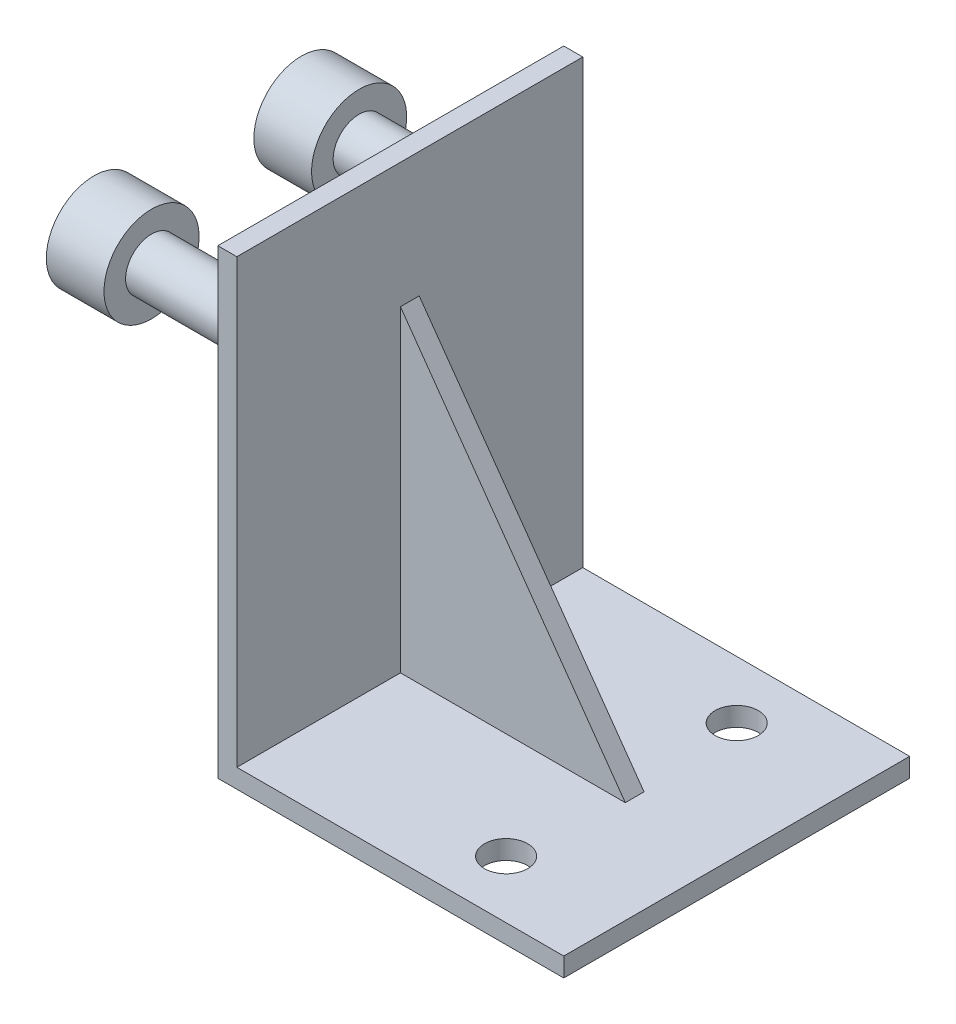
ISO-10303-21;
HEADER;
FILE_DESCRIPTION(('STEP AP214'),'2;1');
FILE_NAME('part.step','',(''),(''),'','','');
FILE_SCHEMA(('AUTOMOTIVE_DESIGN { 1 0 10303 214 1 1 1 1 }'));
ENDSEC;
DATA;
#1=APPLICATION_CONTEXT('core data for automotive mechanical design processes');
#2=APPLICATION_PROTOCOL_DEFINITION('international standard','automotive_design',2000,#1);
#3=PRODUCT_CONTEXT('',#1,'mechanical');
#4=PRODUCT('Part','Part','',(#3));
#5=PRODUCT_RELATED_PRODUCT_CATEGORY('part','',(#4));
#6=PRODUCT_DEFINITION_FORMATION('','',#4);
#7=PRODUCT_DEFINITION_CONTEXT('part definition',#1,'design');
#8=PRODUCT_DEFINITION('design','',#6,#7);
#9=PRODUCT_DEFINITION_SHAPE('','',#8);
#10=(LENGTH_UNIT() NAMED_UNIT(*) SI_UNIT(.MILLI.,.METRE.));
#11=(NAMED_UNIT(*) PLANE_ANGLE_UNIT() SI_UNIT($,.RADIAN.));
#12=(NAMED_UNIT(*) SI_UNIT($,.STERADIAN.) SOLID_ANGLE_UNIT());
#13=UNCERTAINTY_MEASURE_WITH_UNIT(LENGTH_MEASURE(1.E-05),#10,'distance_accuracy_value','');
#14=(GEOMETRIC_REPRESENTATION_CONTEXT(3) GLOBAL_UNCERTAINTY_ASSIGNED_CONTEXT((#13)) GLOBAL_UNIT_ASSIGNED_CONTEXT((#10,
#11,#12)) REPRESENTATION_CONTEXT('',''));
#15=CARTESIAN_POINT('',(0.,0.,0.));
#16=DIRECTION('',(0.,0.,1.));
#17=DIRECTION('',(1.,0.,0.));
#18=AXIS2_PLACEMENT_3D('',#15,#16,#17);
#19=CARTESIAN_POINT('',(0.,40.64,15.24));
#20=DIRECTION('',(0.,1.,0.));
#21=DIRECTION('',(0.,0.,1.));
#22=AXIS2_PLACEMENT_3D('',#19,#20,#21);
#23=PLANE('',#22);
#24=DIRECTION('',(1.,0.,0.));
#25=VECTOR('',#24,1.);
#26=CARTESIAN_POINT('',(0.,40.64,-15.24));
#27=LINE('',#26,#25);
#28=CARTESIAN_POINT('',(0.,40.64,-15.24));
#29=VERTEX_POINT('',#28);
#30=CARTESIAN_POINT('',(1.6764,40.64,-15.24));
#31=VERTEX_POINT('',#30);
#32=EDGE_CURVE('E161',#29,#31,#27,.T.);
#33=ORIENTED_EDGE('',*,*,#32,.F.);
#34=DIRECTION('',(0.,0.,-1.));
#35=VECTOR('',#34,1.);
#36=CARTESIAN_POINT('',(0.,40.64,15.24));
#37=LINE('',#36,#35);
#38=CARTESIAN_POINT('',(0.,40.64,15.24));
#39=VERTEX_POINT('',#38);
#40=EDGE_CURVE('E69',#39,#29,#37,.T.);
#41=ORIENTED_EDGE('',*,*,#40,.F.);
#42=DIRECTION('',(1.,0.,0.));
#43=VECTOR('',#42,1.);
#44=CARTESIAN_POINT('',(0.,40.64,15.24));
#45=LINE('',#44,#43);
#46=CARTESIAN_POINT('',(1.6764,40.64,15.24));
#47=VERTEX_POINT('',#46);
#48=EDGE_CURVE('E181',#39,#47,#45,.T.);
#49=ORIENTED_EDGE('',*,*,#48,.T.);
#50=DIRECTION('',(0.,0.,-1.));
#51=VECTOR('',#50,1.);
#52=CARTESIAN_POINT('',(1.6764,40.64,15.24));
#53=LINE('',#52,#51);
#54=EDGE_CURVE('E106',#47,#31,#53,.T.);
#55=ORIENTED_EDGE('',*,*,#54,.T.);
#56=EDGE_LOOP('',(#33,#41,#49,#55));
#57=FACE_BOUND('',#56,.T.);
#58=ADVANCED_FACE('F42',(#57),#23,.T.);
#59=CARTESIAN_POINT('',(0.,40.64,15.24));
#60=DIRECTION('',(1.,0.,0.));
#61=DIRECTION('',(0.,0.,-1.));
#62=AXIS2_PLACEMENT_3D('',#59,#60,#61);
#63=PLANE('',#62);
#64=CARTESIAN_POINT('',(0.,30.226,9.144));
#65=DIRECTION('',(1.,0.,0.));
#66=DIRECTION('',(0.,0.,-1.));
#67=AXIS2_PLACEMENT_3D('',#64,#65,#66);
#68=CIRCLE('',#67,2.286);
#69=CARTESIAN_POINT('',(0.,30.226,6.858));
#70=VERTEX_POINT('',#69);
#71=EDGE_CURVE('E11',#70,#70,#68,.F.);
#72=ORIENTED_EDGE('',*,*,#71,.F.);
#73=EDGE_LOOP('',(#72));
#74=FACE_BOUND('',#73,.T.);
#75=CARTESIAN_POINT('',(0.,30.226,-9.144));
#76=DIRECTION('',(1.,0.,0.));
#77=DIRECTION('',(0.,0.,-1.));
#78=AXIS2_PLACEMENT_3D('',#75,#76,#77);
#79=CIRCLE('',#78,2.286);
#80=CARTESIAN_POINT('',(0.,30.226,-11.43));
#81=VERTEX_POINT('',#80);
#82=EDGE_CURVE('E50',#81,#81,#79,.F.);
#83=ORIENTED_EDGE('',*,*,#82,.F.);
#84=EDGE_LOOP('',(#83));
#85=FACE_BOUND('',#84,.T.);
#86=DIRECTION('',(0.,-1.,0.));
#87=VECTOR('',#86,1.);
#88=CARTESIAN_POINT('',(0.,40.64,-15.24));
#89=LINE('',#88,#87);
#90=CARTESIAN_POINT('',(0.,0.,-15.24));
#91=VERTEX_POINT('',#90);
#92=EDGE_CURVE('E178',#29,#91,#89,.T.);
#93=ORIENTED_EDGE('',*,*,#92,.T.);
#94=DIRECTION('',(0.,0.,-1.));
#95=VECTOR('',#94,1.);
#96=CARTESIAN_POINT('',(0.,0.,15.24));
#97=LINE('',#96,#95);
#98=CARTESIAN_POINT('',(0.,0.,15.24));
#99=VERTEX_POINT('',#98);
#100=EDGE_CURVE('E145',#99,#91,#97,.T.);
#101=ORIENTED_EDGE('',*,*,#100,.F.);
#102=DIRECTION('',(0.,-1.,0.));
#103=VECTOR('',#102,1.);
#104=CARTESIAN_POINT('',(0.,40.64,15.24));
#105=LINE('',#104,#103);
#106=EDGE_CURVE('E130',#39,#99,#105,.T.);
#107=ORIENTED_EDGE('',*,*,#106,.F.);
#108=ORIENTED_EDGE('',*,*,#40,.T.);
#109=EDGE_LOOP('',(#93,#101,#107,#108));
#110=FACE_BOUND('',#109,.T.);
#111=ADVANCED_FACE('F198',(#74,#85,#110),#63,.F.);
#112=CARTESIAN_POINT('',(0.,0.,15.24));
#113=DIRECTION('',(0.,1.,0.));
#114=DIRECTION('',(0.,0.,1.));
#115=AXIS2_PLACEMENT_3D('',#112,#113,#114);
#116=PLANE('',#115);
#117=CARTESIAN_POINT('',(20.32,0.,-10.16));
#118=DIRECTION('',(0.,1.,0.));
#119=DIRECTION('',(0.,0.,1.));
#120=AXIS2_PLACEMENT_3D('',#117,#118,#119);
#121=CIRCLE('',#120,1.905);
#122=CARTESIAN_POINT('',(20.32,0.,-8.255));
#123=VERTEX_POINT('',#122);
#124=EDGE_CURVE('E233',#123,#123,#121,.T.);
#125=ORIENTED_EDGE('',*,*,#124,.T.);
#126=EDGE_LOOP('',(#125));
#127=FACE_BOUND('',#126,.T.);
#128=CARTESIAN_POINT('',(20.32,0.,10.16));
#129=DIRECTION('',(0.,1.,0.));
#130=DIRECTION('',(0.,0.,1.));
#131=AXIS2_PLACEMENT_3D('',#128,#129,#130);
#132=CIRCLE('',#131,1.905);
#133=CARTESIAN_POINT('',(20.32,0.,12.065));
#134=VERTEX_POINT('',#133);
#135=EDGE_CURVE('E248',#134,#134,#132,.T.);
#136=ORIENTED_EDGE('',*,*,#135,.T.);
#137=EDGE_LOOP('',(#136));
#138=FACE_BOUND('',#137,.T.);
#139=DIRECTION('',(1.,0.,0.));
#140=VECTOR('',#139,1.);
#141=CARTESIAN_POINT('',(0.,0.,-15.24));
#142=LINE('',#141,#140);
#143=CARTESIAN_POINT('',(30.48,0.,-15.24));
#144=VERTEX_POINT('',#143);
#145=EDGE_CURVE('E140',#91,#144,#142,.T.);
#146=ORIENTED_EDGE('',*,*,#145,.T.);
#147=DIRECTION('',(0.,0.,-1.));
#148=VECTOR('',#147,1.);
#149=CARTESIAN_POINT('',(30.48,0.,15.24));
#150=LINE('',#149,#148);
#151=CARTESIAN_POINT('',(30.48,0.,15.24));
#152=VERTEX_POINT('',#151);
#153=EDGE_CURVE('E137',#152,#144,#150,.T.);
#154=ORIENTED_EDGE('',*,*,#153,.F.);
#155=DIRECTION('',(1.,0.,0.));
#156=VECTOR('',#155,1.);
#157=CARTESIAN_POINT('',(0.,0.,15.24));
#158=LINE('',#157,#156);
#159=EDGE_CURVE('E122',#99,#152,#158,.T.);
#160=ORIENTED_EDGE('',*,*,#159,.F.);
#161=ORIENTED_EDGE('',*,*,#100,.T.);
#162=EDGE_LOOP('',(#146,#154,#160,#161));
#163=FACE_BOUND('',#162,.T.);
#164=ADVANCED_FACE('F138',(#127,#138,#163),#116,.F.);
#165=CARTESIAN_POINT('',(30.48,0.,15.24));
#166=DIRECTION('',(-1.,0.,0.));
#167=DIRECTION('',(0.,0.,1.));
#168=AXIS2_PLACEMENT_3D('',#165,#166,#167);
#169=PLANE('',#168);
#170=DIRECTION('',(0.,1.,0.));
#171=VECTOR('',#170,1.);
#172=CARTESIAN_POINT('',(30.48,0.,-15.24));
#173=LINE('',#172,#171);
#174=CARTESIAN_POINT('',(30.48,1.6764,-15.24));
#175=VERTEX_POINT('',#174);
#176=EDGE_CURVE('E173',#144,#175,#173,.T.);
#177=ORIENTED_EDGE('',*,*,#176,.T.);
#178=DIRECTION('',(0.,0.,-1.));
#179=VECTOR('',#178,1.);
#180=CARTESIAN_POINT('',(30.48,1.6764,15.24));
#181=LINE('',#180,#179);
#182=CARTESIAN_POINT('',(30.48,1.6764,15.24));
#183=VERTEX_POINT('',#182);
#184=EDGE_CURVE('E146',#183,#175,#181,.T.);
#185=ORIENTED_EDGE('',*,*,#184,.F.);
#186=DIRECTION('',(0.,1.,0.));
#187=VECTOR('',#186,1.);
#188=CARTESIAN_POINT('',(30.48,0.,15.24));
#189=LINE('',#188,#187);
#190=EDGE_CURVE('E128',#152,#183,#189,.T.);
#191=ORIENTED_EDGE('',*,*,#190,.F.);
#192=ORIENTED_EDGE('',*,*,#153,.T.);
#193=EDGE_LOOP('',(#177,#185,#191,#192));
#194=FACE_BOUND('',#193,.T.);
#195=ADVANCED_FACE('F148',(#194),#169,.F.);
#196=CARTESIAN_POINT('',(1.6764,1.6764,15.24));
#197=DIRECTION('',(0.,1.,0.));
#198=DIRECTION('',(0.,0.,1.));
#199=AXIS2_PLACEMENT_3D('',#196,#197,#198);
#200=PLANE('',#199);
#201=CARTESIAN_POINT('',(20.32,1.6764,-10.16));
#202=DIRECTION('',(0.,1.,0.));
#203=DIRECTION('',(0.,0.,1.));
#204=AXIS2_PLACEMENT_3D('',#201,#202,#203);
#205=CIRCLE('',#204,1.905);
#206=CARTESIAN_POINT('',(20.32,1.6764,-8.255));
#207=VERTEX_POINT('',#206);
#208=EDGE_CURVE('E253',#207,#207,#205,.T.);
#209=ORIENTED_EDGE('',*,*,#208,.F.);
#210=EDGE_LOOP('',(#209));
#211=FACE_BOUND('',#210,.T.);
#212=CARTESIAN_POINT('',(20.32,1.6764,10.16));
#213=DIRECTION('',(0.,1.,0.));
#214=DIRECTION('',(0.,0.,1.));
#215=AXIS2_PLACEMENT_3D('',#212,#213,#214);
#216=CIRCLE('',#215,1.905);
#217=CARTESIAN_POINT('',(20.32,1.6764,12.065));
#218=VERTEX_POINT('',#217);
#219=EDGE_CURVE('E244',#218,#218,#216,.T.);
#220=ORIENTED_EDGE('',*,*,#219,.F.);
#221=EDGE_LOOP('',(#220));
#222=FACE_BOUND('',#221,.T.);
#223=DIRECTION('',(1.,0.,0.));
#224=VECTOR('',#223,1.);
#225=CARTESIAN_POINT('',(21.4884,1.6764,0.8255));
#226=LINE('',#225,#224);
#227=CARTESIAN_POINT('',(1.6764,1.6764,0.8255));
#228=VERTEX_POINT('',#227);
#229=CARTESIAN_POINT('',(21.4884,1.6764,0.8255));
#230=VERTEX_POINT('',#229);
#231=EDGE_CURVE('E237',#228,#230,#226,.T.);
#232=ORIENTED_EDGE('',*,*,#231,.F.);
#233=DIRECTION('',(0.,0.,-1.));
#234=VECTOR('',#233,1.);
#235=CARTESIAN_POINT('',(1.6764,1.6764,15.24));
#236=LINE('',#235,#234);
#237=CARTESIAN_POINT('',(1.6764,1.6764,15.24));
#238=VERTEX_POINT('',#237);
#239=EDGE_CURVE('E187',#238,#228,#236,.T.);
#240=ORIENTED_EDGE('',*,*,#239,.F.);
#241=DIRECTION('',(1.,0.,0.));
#242=VECTOR('',#241,1.);
#243=CARTESIAN_POINT('',(1.6764,1.6764,15.24));
#244=LINE('',#243,#242);
#245=EDGE_CURVE('E151',#238,#183,#244,.T.);
#246=ORIENTED_EDGE('',*,*,#245,.T.);
#247=ORIENTED_EDGE('',*,*,#184,.T.);
#248=DIRECTION('',(1.,0.,0.));
#249=VECTOR('',#248,1.);
#250=CARTESIAN_POINT('',(1.6764,1.6764,-15.24));
#251=LINE('',#250,#249);
#252=CARTESIAN_POINT('',(1.6764,1.6764,-15.24));
#253=VERTEX_POINT('',#252);
#254=EDGE_CURVE('E169',#253,#175,#251,.T.);
#255=ORIENTED_EDGE('',*,*,#254,.F.);
#256=CARTESIAN_POINT('',(1.6764,1.6764,-0.825499999999995));
#257=VERTEX_POINT('',#256);
#258=EDGE_CURVE('E191',#257,#253,#236,.T.);
#259=ORIENTED_EDGE('',*,*,#258,.F.);
#260=DIRECTION('',(1.,0.,0.));
#261=VECTOR('',#260,1.);
#262=CARTESIAN_POINT('',(21.4884,1.6764,-0.8255));
#263=LINE('',#262,#261);
#264=CARTESIAN_POINT('',(21.4884,1.6764,-0.8255));
#265=VERTEX_POINT('',#264);
#266=EDGE_CURVE('E60',#257,#265,#263,.T.);
#267=ORIENTED_EDGE('',*,*,#266,.T.);
#268=DIRECTION('',(0.,0.,-1.));
#269=VECTOR('',#268,1.);
#270=CARTESIAN_POINT('',(21.4884,1.6764,0.8255));
#271=LINE('',#270,#269);
#272=EDGE_CURVE('E165',#230,#265,#271,.T.);
#273=ORIENTED_EDGE('',*,*,#272,.F.);
#274=EDGE_LOOP('',(#232,#240,#246,#247,#255,#259,#267,#273));
#275=FACE_BOUND('',#274,.T.);
#276=ADVANCED_FACE('F208',(#211,#222,#275),#200,.T.);
#277=CARTESIAN_POINT('',(1.6764,40.64,15.24));
#278=DIRECTION('',(1.,0.,0.));
#279=DIRECTION('',(0.,1.,0.));
#280=AXIS2_PLACEMENT_3D('',#277,#278,#279);
#281=PLANE('',#280);
#282=DIRECTION('',(0.,-1.,0.));
#283=VECTOR('',#282,1.);
#284=CARTESIAN_POINT('',(1.6764,1.6764,0.8255));
#285=LINE('',#284,#283);
#286=CARTESIAN_POINT('',(1.6764,29.6164,0.8255));
#287=VERTEX_POINT('',#286);
#288=EDGE_CURVE('E227',#287,#228,#285,.T.);
#289=ORIENTED_EDGE('',*,*,#288,.F.);
#290=DIRECTION('',(0.,0.,-1.));
#291=VECTOR('',#290,1.);
#292=CARTESIAN_POINT('',(1.6764,29.6164,0.8255));
#293=LINE('',#292,#291);
#294=CARTESIAN_POINT('',(1.6764,29.6164,-0.8255));
#295=VERTEX_POINT('',#294);
#296=EDGE_CURVE('E218',#287,#295,#293,.T.);
#297=ORIENTED_EDGE('',*,*,#296,.T.);
#298=DIRECTION('',(0.,-1.,0.));
#299=VECTOR('',#298,1.);
#300=CARTESIAN_POINT('',(1.6764,1.6764,-0.8255));
#301=LINE('',#300,#299);
#302=EDGE_CURVE('E230',#295,#257,#301,.T.);
#303=ORIENTED_EDGE('',*,*,#302,.T.);
#304=ORIENTED_EDGE('',*,*,#258,.T.);
#305=DIRECTION('',(0.,-1.,0.));
#306=VECTOR('',#305,1.);
#307=CARTESIAN_POINT('',(1.6764,40.64,-15.24));
#308=LINE('',#307,#306);
#309=EDGE_CURVE('E164',#31,#253,#308,.T.);
#310=ORIENTED_EDGE('',*,*,#309,.F.);
#311=ORIENTED_EDGE('',*,*,#54,.F.);
#312=DIRECTION('',(0.,-1.,0.));
#313=VECTOR('',#312,1.);
#314=CARTESIAN_POINT('',(1.6764,40.64,15.24));
#315=LINE('',#314,#313);
#316=EDGE_CURVE('E155',#47,#238,#315,.T.);
#317=ORIENTED_EDGE('',*,*,#316,.T.);
#318=ORIENTED_EDGE('',*,*,#239,.T.);
#319=EDGE_LOOP('',(#289,#297,#303,#304,#310,#311,#317,#318));
#320=FACE_BOUND('',#319,.T.);
#321=ADVANCED_FACE('F210',(#320),#281,.T.);
#322=CARTESIAN_POINT('',(0.,0.,15.24));
#323=DIRECTION('',(0.,0.,-1.));
#324=DIRECTION('',(-1.,0.,0.));
#325=AXIS2_PLACEMENT_3D('',#322,#323,#324);
#326=PLANE('',#325);
#327=ORIENTED_EDGE('',*,*,#48,.F.);
#328=ORIENTED_EDGE('',*,*,#106,.T.);
#329=ORIENTED_EDGE('',*,*,#159,.T.);
#330=ORIENTED_EDGE('',*,*,#190,.T.);
#331=ORIENTED_EDGE('',*,*,#245,.F.);
#332=ORIENTED_EDGE('',*,*,#316,.F.);
#333=EDGE_LOOP('',(#327,#328,#329,#330,#331,#332));
#334=FACE_BOUND('',#333,.T.);
#335=ADVANCED_FACE('F125',(#334),#326,.F.);
#336=CARTESIAN_POINT('',(0.,0.,-15.24));
#337=DIRECTION('',(0.,0.,-1.));
#338=DIRECTION('',(-1.,0.,0.));
#339=AXIS2_PLACEMENT_3D('',#336,#337,#338);
#340=PLANE('',#339);
#341=ORIENTED_EDGE('',*,*,#32,.T.);
#342=ORIENTED_EDGE('',*,*,#309,.T.);
#343=ORIENTED_EDGE('',*,*,#254,.T.);
#344=ORIENTED_EDGE('',*,*,#176,.F.);
#345=ORIENTED_EDGE('',*,*,#145,.F.);
#346=ORIENTED_EDGE('',*,*,#92,.F.);
#347=EDGE_LOOP('',(#341,#342,#343,#344,#345,#346));
#348=FACE_BOUND('',#347,.T.);
#349=ADVANCED_FACE('F203',(#348),#340,.T.);
#350=CARTESIAN_POINT('',(1.6764,29.6164,0.8255));
#351=DIRECTION('',(-0.81573289107529,-0.578428777307933,0.));
#352=DIRECTION('',(0.578428777307933,-0.81573289107529,0.));
#353=AXIS2_PLACEMENT_3D('',#350,#351,#352);
#354=PLANE('',#353);
#355=DIRECTION('',(-0.578428777307933,0.815732891075289,0.));
#356=VECTOR('',#355,1.);
#357=CARTESIAN_POINT('',(1.6764,29.6164,-0.8255));
#358=LINE('',#357,#356);
#359=EDGE_CURVE('E223',#265,#295,#358,.T.);
#360=ORIENTED_EDGE('',*,*,#359,.T.);
#361=ORIENTED_EDGE('',*,*,#296,.F.);
#362=DIRECTION('',(-0.578428777307933,0.815732891075289,0.));
#363=VECTOR('',#362,1.);
#364=CARTESIAN_POINT('',(1.6764,29.6164,0.8255));
#365=LINE('',#364,#363);
#366=EDGE_CURVE('E222',#230,#287,#365,.T.);
#367=ORIENTED_EDGE('',*,*,#366,.F.);
#368=ORIENTED_EDGE('',*,*,#272,.T.);
#369=EDGE_LOOP('',(#360,#361,#367,#368));
#370=FACE_BOUND('',#369,.T.);
#371=ADVANCED_FACE('F318',(#370),#354,.F.);
#372=CARTESIAN_POINT('',(0.,0.,0.8255));
#373=DIRECTION('',(0.,0.,1.));
#374=DIRECTION('',(1.,0.,0.));
#375=AXIS2_PLACEMENT_3D('',#372,#373,#374);
#376=PLANE('',#375);
#377=ORIENTED_EDGE('',*,*,#288,.T.);
#378=ORIENTED_EDGE('',*,*,#231,.T.);
#379=ORIENTED_EDGE('',*,*,#366,.T.);
#380=EDGE_LOOP('',(#377,#378,#379));
#381=FACE_BOUND('',#380,.T.);
#382=ADVANCED_FACE('F317',(#381),#376,.T.);
#383=CARTESIAN_POINT('',(0.,0.,-0.8255));
#384=DIRECTION('',(0.,0.,1.));
#385=DIRECTION('',(1.,0.,0.));
#386=AXIS2_PLACEMENT_3D('',#383,#384,#385);
#387=PLANE('',#386);
#388=ORIENTED_EDGE('',*,*,#302,.F.);
#389=ORIENTED_EDGE('',*,*,#359,.F.);
#390=ORIENTED_EDGE('',*,*,#266,.F.);
#391=EDGE_LOOP('',(#388,#389,#390));
#392=FACE_BOUND('',#391,.T.);
#393=ADVANCED_FACE('F304',(#392),#387,.F.);
#394=CARTESIAN_POINT('',(20.32,0.,10.16));
#395=DIRECTION('',(0.,1.,0.));
#396=DIRECTION('',(0.,0.,1.));
#397=AXIS2_PLACEMENT_3D('',#394,#395,#396);
#398=CYLINDRICAL_SURFACE('',#397,1.905);
#399=ORIENTED_EDGE('',*,*,#135,.F.);
#400=EDGE_LOOP('',(#399));
#401=FACE_BOUND('',#400,.T.);
#402=ORIENTED_EDGE('',*,*,#219,.T.);
#403=EDGE_LOOP('',(#402));
#404=FACE_BOUND('',#403,.T.);
#405=ADVANCED_FACE('F419',(#401,#404),#398,.F.);
#406=CARTESIAN_POINT('',(20.32,0.,-10.16));
#407=DIRECTION('',(0.,1.,0.));
#408=DIRECTION('',(0.,0.,1.));
#409=AXIS2_PLACEMENT_3D('',#406,#407,#408);
#410=CYLINDRICAL_SURFACE('',#409,1.905);
#411=ORIENTED_EDGE('',*,*,#124,.F.);
#412=EDGE_LOOP('',(#411));
#413=FACE_BOUND('',#412,.T.);
#414=ORIENTED_EDGE('',*,*,#208,.T.);
#415=EDGE_LOOP('',(#414));
#416=FACE_BOUND('',#415,.T.);
#417=ADVANCED_FACE('F348',(#413,#416),#410,.F.);
#418=CARTESIAN_POINT('',(-11.938,30.226,-9.144));
#419=DIRECTION('',(1.,0.,0.));
#420=DIRECTION('',(0.,0.,-1.));
#421=AXIS2_PLACEMENT_3D('',#418,#419,#420);
#422=CYLINDRICAL_SURFACE('',#421,2.286);
#423=CARTESIAN_POINT('',(-11.938,30.226,-9.144));
#424=DIRECTION('',(-1.,0.,0.));
#425=DIRECTION('',(0.,0.,1.));
#426=AXIS2_PLACEMENT_3D('',#423,#424,#425);
#427=CIRCLE('',#426,2.286);
#428=CARTESIAN_POINT('',(-11.938,30.226,-6.858));
#429=VERTEX_POINT('',#428);
#430=EDGE_CURVE('E249',#429,#429,#427,.T.);
#431=ORIENTED_EDGE('',*,*,#430,.F.);
#432=EDGE_LOOP('',(#431));
#433=FACE_BOUND('',#432,.T.);
#434=ORIENTED_EDGE('',*,*,#82,.T.);
#435=EDGE_LOOP('',(#434));
#436=FACE_BOUND('',#435,.T.);
#437=ADVANCED_FACE('F196',(#433,#436),#422,.T.);
#438=CARTESIAN_POINT('',(-11.938,30.226,9.144));
#439=DIRECTION('',(1.,0.,0.));
#440=DIRECTION('',(0.,0.,-1.));
#441=AXIS2_PLACEMENT_3D('',#438,#439,#440);
#442=CYLINDRICAL_SURFACE('',#441,2.286);
#443=CARTESIAN_POINT('',(-11.938,30.226,9.144));
#444=DIRECTION('',(-1.,0.,0.));
#445=DIRECTION('',(0.,0.,1.));
#446=AXIS2_PLACEMENT_3D('',#443,#444,#445);
#447=CIRCLE('',#446,2.286);
#448=CARTESIAN_POINT('',(-11.938,30.226,11.43));
#449=VERTEX_POINT('',#448);
#450=EDGE_CURVE('E262',#449,#449,#447,.T.);
#451=ORIENTED_EDGE('',*,*,#450,.F.);
#452=EDGE_LOOP('',(#451));
#453=FACE_BOUND('',#452,.T.);
#454=ORIENTED_EDGE('',*,*,#71,.T.);
#455=EDGE_LOOP('',(#454));
#456=FACE_BOUND('',#455,.T.);
#457=ADVANCED_FACE('F357',(#453,#456),#442,.T.);
#458=CARTESIAN_POINT('',(-17.018,30.226,-9.144));
#459=DIRECTION('',(1.,0.,0.));
#460=DIRECTION('',(0.,0.,-1.));
#461=AXIS2_PLACEMENT_3D('',#458,#459,#460);
#462=CYLINDRICAL_SURFACE('',#461,4.191);
#463=CARTESIAN_POINT('',(-17.018,30.226,-9.144));
#464=DIRECTION('',(-1.,0.,0.));
#465=DIRECTION('',(0.,0.,1.));
#466=AXIS2_PLACEMENT_3D('',#463,#464,#465);
#467=CIRCLE('',#466,4.191);
#468=CARTESIAN_POINT('',(-17.018,30.226,-4.953));
#469=VERTEX_POINT('',#468);
#470=EDGE_CURVE('E266',#469,#469,#467,.T.);
#471=ORIENTED_EDGE('',*,*,#470,.F.);
#472=EDGE_LOOP('',(#471));
#473=FACE_BOUND('',#472,.T.);
#474=CARTESIAN_POINT('',(-11.938,30.226,-9.144));
#475=DIRECTION('',(-1.,0.,0.));
#476=DIRECTION('',(0.,0.,1.));
#477=AXIS2_PLACEMENT_3D('',#474,#475,#476);
#478=CIRCLE('',#477,4.191);
#479=CARTESIAN_POINT('',(-11.938,30.226,-4.953));
#480=VERTEX_POINT('',#479);
#481=EDGE_CURVE('E267',#480,#480,#478,.T.);
#482=ORIENTED_EDGE('',*,*,#481,.T.);
#483=EDGE_LOOP('',(#482));
#484=FACE_BOUND('',#483,.T.);
#485=ADVANCED_FACE('F367',(#473,#484),#462,.T.);
#486=CARTESIAN_POINT('',(-17.018,30.226,-9.144));
#487=DIRECTION('',(-1.,0.,0.));
#488=DIRECTION('',(0.,0.,1.));
#489=AXIS2_PLACEMENT_3D('',#486,#487,#488);
#490=PLANE('',#489);
#491=ORIENTED_EDGE('',*,*,#470,.T.);
#492=EDGE_LOOP('',(#491));
#493=FACE_BOUND('',#492,.T.);
#494=ADVANCED_FACE('F377',(#493),#490,.T.);
#495=CARTESIAN_POINT('',(-11.938,30.226,-9.144));
#496=DIRECTION('',(-1.,0.,0.));
#497=DIRECTION('',(0.,0.,1.));
#498=AXIS2_PLACEMENT_3D('',#495,#496,#497);
#499=PLANE('',#498);
#500=ORIENTED_EDGE('',*,*,#430,.T.);
#501=EDGE_LOOP('',(#500));
#502=FACE_BOUND('',#501,.T.);
#503=ORIENTED_EDGE('',*,*,#481,.F.);
#504=EDGE_LOOP('',(#503));
#505=FACE_BOUND('',#504,.T.);
#506=ADVANCED_FACE('F286',(#502,#505),#499,.F.);
#507=CARTESIAN_POINT('',(-17.018,30.226,9.144));
#508=DIRECTION('',(1.,0.,0.));
#509=DIRECTION('',(0.,0.,-1.));
#510=AXIS2_PLACEMENT_3D('',#507,#508,#509);
#511=CYLINDRICAL_SURFACE('',#510,4.191);
#512=CARTESIAN_POINT('',(-17.018,30.226,9.144));
#513=DIRECTION('',(-1.,0.,0.));
#514=DIRECTION('',(0.,0.,1.));
#515=AXIS2_PLACEMENT_3D('',#512,#513,#514);
#516=CIRCLE('',#515,4.191);
#517=CARTESIAN_POINT('',(-17.018,30.226,13.335));
#518=VERTEX_POINT('',#517);
#519=EDGE_CURVE('E270',#518,#518,#516,.T.);
#520=ORIENTED_EDGE('',*,*,#519,.F.);
#521=EDGE_LOOP('',(#520));
#522=FACE_BOUND('',#521,.T.);
#523=CARTESIAN_POINT('',(-11.938,30.226,9.144));
#524=DIRECTION('',(-1.,0.,0.));
#525=DIRECTION('',(0.,0.,1.));
#526=AXIS2_PLACEMENT_3D('',#523,#524,#525);
#527=CIRCLE('',#526,4.191);
#528=CARTESIAN_POINT('',(-11.938,30.226,13.335));
#529=VERTEX_POINT('',#528);
#530=EDGE_CURVE('E273',#529,#529,#527,.T.);
#531=ORIENTED_EDGE('',*,*,#530,.T.);
#532=EDGE_LOOP('',(#531));
#533=FACE_BOUND('',#532,.T.);
#534=ADVANCED_FACE('F283',(#522,#533),#511,.T.);
#535=CARTESIAN_POINT('',(-17.018,30.226,9.144));
#536=DIRECTION('',(-1.,0.,0.));
#537=DIRECTION('',(0.,0.,1.));
#538=AXIS2_PLACEMENT_3D('',#535,#536,#537);
#539=PLANE('',#538);
#540=ORIENTED_EDGE('',*,*,#519,.T.);
#541=EDGE_LOOP('',(#540));
#542=FACE_BOUND('',#541,.T.);
#543=ADVANCED_FACE('F281',(#542),#539,.T.);
#544=CARTESIAN_POINT('',(-11.938,30.226,9.144));
#545=DIRECTION('',(-1.,0.,0.));
#546=DIRECTION('',(0.,0.,1.));
#547=AXIS2_PLACEMENT_3D('',#544,#545,#546);
#548=PLANE('',#547);
#549=ORIENTED_EDGE('',*,*,#450,.T.);
#550=EDGE_LOOP('',(#549));
#551=FACE_BOUND('',#550,.T.);
#552=ORIENTED_EDGE('',*,*,#530,.F.);
#553=EDGE_LOOP('',(#552));
#554=FACE_BOUND('',#553,.T.);
#555=ADVANCED_FACE('F290',(#551,#554),#548,.F.);
#556=CLOSED_SHELL('',(#58,#111,#164,#195,#276,#321,#335,#349,#371,#382,#393,#405,#417,#437,#457,
#485,#494,#506,#534,#543,#555));
#557=MANIFOLD_SOLID_BREP('B2',#556);
#558=ADVANCED_BREP_SHAPE_REPRESENTATION('',(#18,#557),#14);
#559=SHAPE_DEFINITION_REPRESENTATION(#9,#558);
ENDSEC;
END-ISO-10303-21;
